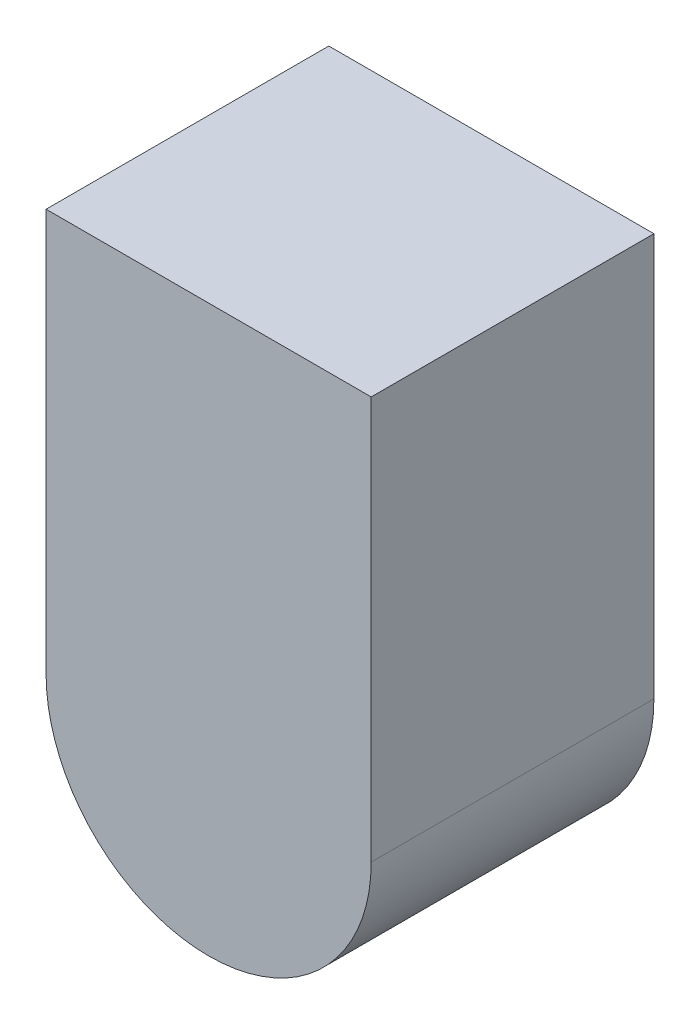
ISO-10303-21;
HEADER;
FILE_DESCRIPTION(('STEP AP214'),'2;1');
FILE_NAME('part.step','',(''),(''),'','','');
FILE_SCHEMA(('AUTOMOTIVE_DESIGN { 1 0 10303 214 1 1 1 1 }'));
ENDSEC;
DATA;
#1=APPLICATION_CONTEXT('core data for automotive mechanical design processes');
#2=APPLICATION_PROTOCOL_DEFINITION('international standard','automotive_design',2000,#1);
#3=PRODUCT_CONTEXT('',#1,'mechanical');
#4=PRODUCT('Part','Part','',(#3));
#5=PRODUCT_RELATED_PRODUCT_CATEGORY('part','',(#4));
#6=PRODUCT_DEFINITION_FORMATION('','',#4);
#7=PRODUCT_DEFINITION_CONTEXT('part definition',#1,'design');
#8=PRODUCT_DEFINITION('design','',#6,#7);
#9=PRODUCT_DEFINITION_SHAPE('','',#8);
#10=(LENGTH_UNIT() NAMED_UNIT(*) SI_UNIT(.MILLI.,.METRE.));
#11=(NAMED_UNIT(*) PLANE_ANGLE_UNIT() SI_UNIT($,.RADIAN.));
#12=(NAMED_UNIT(*) SI_UNIT($,.STERADIAN.) SOLID_ANGLE_UNIT());
#13=UNCERTAINTY_MEASURE_WITH_UNIT(LENGTH_MEASURE(1.E-05),#10,'distance_accuracy_value','');
#14=(GEOMETRIC_REPRESENTATION_CONTEXT(3) GLOBAL_UNCERTAINTY_ASSIGNED_CONTEXT((#13)) GLOBAL_UNIT_ASSIGNED_CONTEXT((#10,
#11,#12)) REPRESENTATION_CONTEXT('',''));
#15=CARTESIAN_POINT('',(0.,0.,0.));
#16=DIRECTION('',(0.,0.,1.));
#17=DIRECTION('',(1.,0.,0.));
#18=AXIS2_PLACEMENT_3D('',#15,#16,#17);
#19=CARTESIAN_POINT('',(1.75,2.8335240809167,0.2));
#20=DIRECTION('',(0.,0.,1.));
#21=DIRECTION('',(1.,0.,0.));
#22=AXIS2_PLACEMENT_3D('',#19,#20,#21);
#23=PLANE('',#22);
#24=DIRECTION('',(0.,1.,0.));
#25=VECTOR('',#24,1.);
#26=CARTESIAN_POINT('',(1.865,2.715,0.2));
#27=LINE('',#26,#25);
#28=CARTESIAN_POINT('',(1.865,2.715,0.2));
#29=VERTEX_POINT('',#28);
#30=CARTESIAN_POINT('',(1.865,3.,0.2));
#31=VERTEX_POINT('',#30);
#32=EDGE_CURVE('E11',#29,#31,#27,.T.);
#33=ORIENTED_EDGE('',*,*,#32,.T.);
#34=DIRECTION('',(-1.,0.,0.));
#35=VECTOR('',#34,1.);
#36=CARTESIAN_POINT('',(2.375,3.,0.2));
#37=LINE('',#36,#35);
#38=CARTESIAN_POINT('',(1.635,3.,0.2));
#39=VERTEX_POINT('',#38);
#40=EDGE_CURVE('E24',#31,#39,#37,.T.);
#41=ORIENTED_EDGE('',*,*,#40,.T.);
#42=DIRECTION('',(0.,-1.,0.));
#43=VECTOR('',#42,1.);
#44=CARTESIAN_POINT('',(1.635,3.,0.2));
#45=LINE('',#44,#43);
#46=CARTESIAN_POINT('',(1.635,2.715,0.2));
#47=VERTEX_POINT('',#46);
#48=EDGE_CURVE('E88',#39,#47,#45,.T.);
#49=ORIENTED_EDGE('',*,*,#48,.T.);
#50=CARTESIAN_POINT('',(1.75,2.715,0.2));
#51=DIRECTION('',(0.,0.,1.));
#52=DIRECTION('',(-1.,0.,0.));
#53=AXIS2_PLACEMENT_3D('',#50,#51,#52);
#54=CIRCLE('',#53,0.115);
#55=EDGE_CURVE('E70',#47,#29,#54,.T.);
#56=ORIENTED_EDGE('',*,*,#55,.T.);
#57=EDGE_LOOP('',(#33,#41,#49,#56));
#58=FACE_BOUND('',#57,.T.);
#59=ADVANCED_FACE('F17',(#58),#23,.T.);
#60=CARTESIAN_POINT('',(3.,3.,0.));
#61=DIRECTION('',(0.,1.,0.));
#62=DIRECTION('',(-1.,0.,0.));
#63=AXIS2_PLACEMENT_3D('',#60,#61,#62);
#64=PLANE('',#63);
#65=DIRECTION('',(0.,0.,-1.));
#66=VECTOR('',#65,1.);
#67=CARTESIAN_POINT('',(1.635,3.,0.));
#68=LINE('',#67,#66);
#69=CARTESIAN_POINT('',(1.635,3.,0.));
#70=VERTEX_POINT('',#69);
#71=EDGE_CURVE('E76',#39,#70,#68,.T.);
#72=ORIENTED_EDGE('',*,*,#71,.F.);
#73=ORIENTED_EDGE('',*,*,#40,.F.);
#74=DIRECTION('',(0.,0.,1.));
#75=VECTOR('',#74,1.);
#76=CARTESIAN_POINT('',(1.865,3.,0.));
#77=LINE('',#76,#75);
#78=CARTESIAN_POINT('',(1.865,3.,0.));
#79=VERTEX_POINT('',#78);
#80=EDGE_CURVE('E84',#79,#31,#77,.T.);
#81=ORIENTED_EDGE('',*,*,#80,.F.);
#82=DIRECTION('',(-1.,0.,0.));
#83=VECTOR('',#82,1.);
#84=CARTESIAN_POINT('',(1.865,3.,0.));
#85=LINE('',#84,#83);
#86=EDGE_CURVE('E82',#79,#70,#85,.T.);
#87=ORIENTED_EDGE('',*,*,#86,.T.);
#88=EDGE_LOOP('',(#72,#73,#81,#87));
#89=FACE_BOUND('',#88,.T.);
#90=ADVANCED_FACE('F90',(#89),#64,.T.);
#91=CARTESIAN_POINT('',(1.865,2.715,0.));
#92=DIRECTION('',(1.,0.,0.));
#93=DIRECTION('',(0.,1.,0.));
#94=AXIS2_PLACEMENT_3D('',#91,#92,#93);
#95=PLANE('',#94);
#96=DIRECTION('',(0.,1.,0.));
#97=VECTOR('',#96,1.);
#98=CARTESIAN_POINT('',(1.865,2.715,0.));
#99=LINE('',#98,#97);
#100=CARTESIAN_POINT('',(1.865,2.715,0.));
#101=VERTEX_POINT('',#100);
#102=EDGE_CURVE('E61',#101,#79,#99,.T.);
#103=ORIENTED_EDGE('',*,*,#102,.T.);
#104=ORIENTED_EDGE('',*,*,#80,.T.);
#105=ORIENTED_EDGE('',*,*,#32,.F.);
#106=DIRECTION('',(0.,0.,1.));
#107=VECTOR('',#106,1.);
#108=CARTESIAN_POINT('',(1.865,2.715,0.));
#109=LINE('',#108,#107);
#110=EDGE_CURVE('E64',#101,#29,#109,.T.);
#111=ORIENTED_EDGE('',*,*,#110,.F.);
#112=EDGE_LOOP('',(#103,#104,#105,#111));
#113=FACE_BOUND('',#112,.T.);
#114=ADVANCED_FACE('F91',(#113),#95,.T.);
#115=CARTESIAN_POINT('',(1.75,2.715,0.));
#116=DIRECTION('',(0.,0.,1.));
#117=DIRECTION('',(-1.,0.,0.));
#118=AXIS2_PLACEMENT_3D('',#115,#116,#117);
#119=CYLINDRICAL_SURFACE('',#118,0.115);
#120=CARTESIAN_POINT('',(1.75,2.715,0.));
#121=DIRECTION('',(0.,0.,1.));
#122=DIRECTION('',(-1.,0.,0.));
#123=AXIS2_PLACEMENT_3D('',#120,#121,#122);
#124=CIRCLE('',#123,0.115);
#125=CARTESIAN_POINT('',(1.635,2.715,0.));
#126=VERTEX_POINT('',#125);
#127=EDGE_CURVE('E54',#126,#101,#124,.T.);
#128=ORIENTED_EDGE('',*,*,#127,.T.);
#129=ORIENTED_EDGE('',*,*,#110,.T.);
#130=ORIENTED_EDGE('',*,*,#55,.F.);
#131=DIRECTION('',(0.,0.,1.));
#132=VECTOR('',#131,1.);
#133=CARTESIAN_POINT('',(1.635,2.715,0.));
#134=LINE('',#133,#132);
#135=EDGE_CURVE('E65',#126,#47,#134,.T.);
#136=ORIENTED_EDGE('',*,*,#135,.F.);
#137=EDGE_LOOP('',(#128,#129,#130,#136));
#138=FACE_BOUND('',#137,.T.);
#139=ADVANCED_FACE('F69',(#138),#119,.T.);
#140=CARTESIAN_POINT('',(1.635,3.,0.));
#141=DIRECTION('',(-1.,0.,0.));
#142=DIRECTION('',(0.,-1.,0.));
#143=AXIS2_PLACEMENT_3D('',#140,#141,#142);
#144=PLANE('',#143);
#145=DIRECTION('',(0.,-1.,0.));
#146=VECTOR('',#145,1.);
#147=CARTESIAN_POINT('',(1.635,3.,0.));
#148=LINE('',#147,#146);
#149=EDGE_CURVE('E59',#70,#126,#148,.T.);
#150=ORIENTED_EDGE('',*,*,#149,.T.);
#151=ORIENTED_EDGE('',*,*,#135,.T.);
#152=ORIENTED_EDGE('',*,*,#48,.F.);
#153=ORIENTED_EDGE('',*,*,#71,.T.);
#154=EDGE_LOOP('',(#150,#151,#152,#153));
#155=FACE_BOUND('',#154,.T.);
#156=ADVANCED_FACE('F74',(#155),#144,.T.);
#157=CARTESIAN_POINT('',(1.75,2.8335265642716,0.));
#158=DIRECTION('',(0.,0.,1.));
#159=DIRECTION('',(0.,-1.,0.));
#160=AXIS2_PLACEMENT_3D('',#157,#158,#159);
#161=PLANE('',#160);
#162=ORIENTED_EDGE('',*,*,#86,.F.);
#163=ORIENTED_EDGE('',*,*,#102,.F.);
#164=ORIENTED_EDGE('',*,*,#127,.F.);
#165=ORIENTED_EDGE('',*,*,#149,.F.);
#166=EDGE_LOOP('',(#162,#163,#164,#165));
#167=FACE_BOUND('',#166,.T.);
#168=ADVANCED_FACE('F57',(#167),#161,.F.);
#169=CLOSED_SHELL('',(#59,#90,#114,#139,#156,#168));
#170=MANIFOLD_SOLID_BREP('B1',#169);
#171=ADVANCED_BREP_SHAPE_REPRESENTATION('',(#18,#170),#14);
#172=SHAPE_DEFINITION_REPRESENTATION(#9,#171);
ENDSEC;
END-ISO-10303-21;
